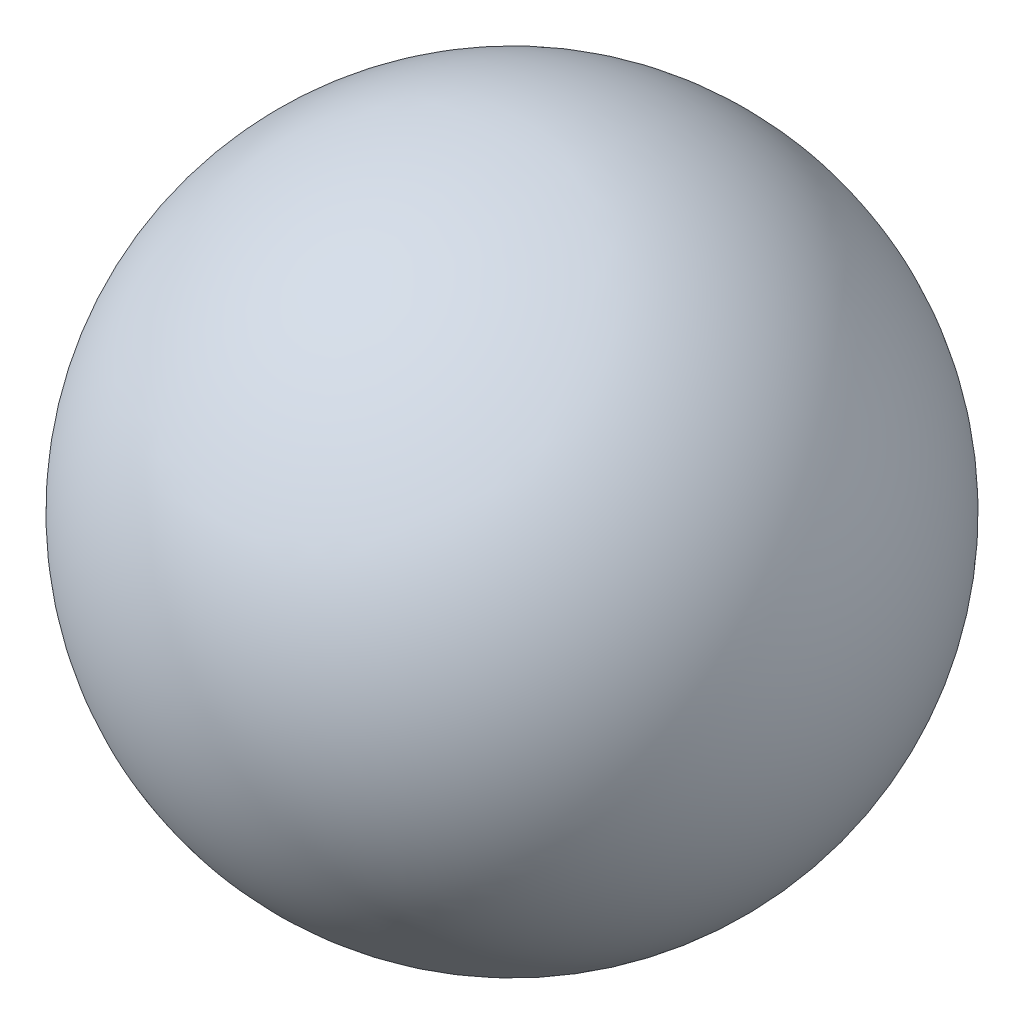
ISO-10303-21;
HEADER;
FILE_DESCRIPTION(('STEP AP214'),'2;1');
FILE_NAME('part.step','',(''),(''),'','','');
FILE_SCHEMA(('AUTOMOTIVE_DESIGN { 1 0 10303 214 1 1 1 1 }'));
ENDSEC;
DATA;
#1=APPLICATION_CONTEXT('core data for automotive mechanical design processes');
#2=APPLICATION_PROTOCOL_DEFINITION('international standard','automotive_design',2000,#1);
#3=PRODUCT_CONTEXT('',#1,'mechanical');
#4=PRODUCT('Part','Part','',(#3));
#5=PRODUCT_RELATED_PRODUCT_CATEGORY('part','',(#4));
#6=PRODUCT_DEFINITION_FORMATION('','',#4);
#7=PRODUCT_DEFINITION_CONTEXT('part definition',#1,'design');
#8=PRODUCT_DEFINITION('design','',#6,#7);
#9=PRODUCT_DEFINITION_SHAPE('','',#8);
#10=(LENGTH_UNIT() NAMED_UNIT(*) SI_UNIT(.MILLI.,.METRE.));
#11=(NAMED_UNIT(*) PLANE_ANGLE_UNIT() SI_UNIT($,.RADIAN.));
#12=(NAMED_UNIT(*) SI_UNIT($,.STERADIAN.) SOLID_ANGLE_UNIT());
#13=UNCERTAINTY_MEASURE_WITH_UNIT(LENGTH_MEASURE(1.E-05),#10,'distance_accuracy_value','');
#14=(GEOMETRIC_REPRESENTATION_CONTEXT(3) GLOBAL_UNCERTAINTY_ASSIGNED_CONTEXT((#13)) GLOBAL_UNIT_ASSIGNED_CONTEXT((#10,
#11,#12)) REPRESENTATION_CONTEXT('',''));
#15=CARTESIAN_POINT('',(0.,0.,0.));
#16=DIRECTION('',(0.,0.,1.));
#17=DIRECTION('',(1.,0.,0.));
#18=AXIS2_PLACEMENT_3D('',#15,#16,#17);
#19=CARTESIAN_POINT('',(64.16,19.3016172225726,-66.6441915067869));
#20=DIRECTION('',(0.,0.278189430012718,-0.960526231307193));
#21=DIRECTION('',(0.173648177666934,0.945933679562921,0.273963107482572));
#22=AXIS2_PLACEMENT_3D('',#19,#20,#21);
#23=SPHERICAL_SURFACE('',#22,7.15);
#24=CARTESIAN_POINT('',(64.16,21.2906716471635,-73.5119540606333));
#25=VERTEX_POINT('',#24);
#26=VERTEX_LOOP('',#25);
#27=FACE_BOUND('',#26,.T.);
#28=CARTESIAN_POINT('',(64.16,17.3125627979817,-59.7764289529405));
#29=VERTEX_POINT('',#28);
#30=VERTEX_LOOP('',#29);
#31=FACE_BOUND('',#30,.T.);
#32=ADVANCED_FACE('F16',(#27,#31),#23,.T.);
#33=CLOSED_SHELL('',(#32));
#34=MANIFOLD_SOLID_BREP('B1',#33);
#35=ADVANCED_BREP_SHAPE_REPRESENTATION('',(#18,#34),#14);
#36=SHAPE_DEFINITION_REPRESENTATION(#9,#35);
ENDSEC;
END-ISO-10303-21;
